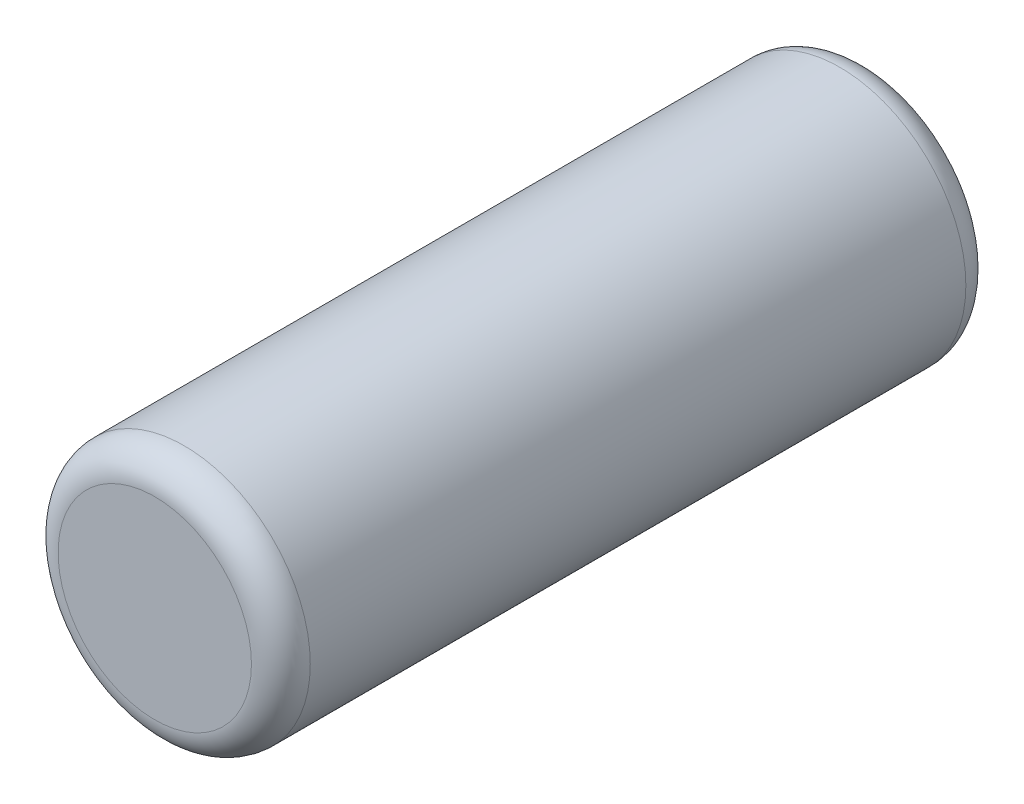
ISO-10303-21;
HEADER;
FILE_DESCRIPTION(('STEP AP214'),'2;1');
FILE_NAME('part.step','',(''),(''),'','','');
FILE_SCHEMA(('AUTOMOTIVE_DESIGN { 1 0 10303 214 1 1 1 1 }'));
ENDSEC;
DATA;
#1=APPLICATION_CONTEXT('core data for automotive mechanical design processes');
#2=APPLICATION_PROTOCOL_DEFINITION('international standard','automotive_design',2000,#1);
#3=PRODUCT_CONTEXT('',#1,'mechanical');
#4=PRODUCT('Part','Part','',(#3));
#5=PRODUCT_RELATED_PRODUCT_CATEGORY('part','',(#4));
#6=PRODUCT_DEFINITION_FORMATION('','',#4);
#7=PRODUCT_DEFINITION_CONTEXT('part definition',#1,'design');
#8=PRODUCT_DEFINITION('design','',#6,#7);
#9=PRODUCT_DEFINITION_SHAPE('','',#8);
#10=(LENGTH_UNIT() NAMED_UNIT(*) SI_UNIT(.MILLI.,.METRE.));
#11=(NAMED_UNIT(*) PLANE_ANGLE_UNIT() SI_UNIT($,.RADIAN.));
#12=(NAMED_UNIT(*) SI_UNIT($,.STERADIAN.) SOLID_ANGLE_UNIT());
#13=UNCERTAINTY_MEASURE_WITH_UNIT(LENGTH_MEASURE(1.E-05),#10,'distance_accuracy_value','');
#14=(GEOMETRIC_REPRESENTATION_CONTEXT(3) GLOBAL_UNCERTAINTY_ASSIGNED_CONTEXT((#13)) GLOBAL_UNIT_ASSIGNED_CONTEXT((#10,
#11,#12)) REPRESENTATION_CONTEXT('',''));
#15=CARTESIAN_POINT('',(0.,0.,0.));
#16=DIRECTION('',(0.,0.,1.));
#17=DIRECTION('',(1.,0.,0.));
#18=AXIS2_PLACEMENT_3D('',#15,#16,#17);
#19=CARTESIAN_POINT('',(0.,0.,4.25));
#20=DIRECTION('',(0.,0.,-1.));
#21=DIRECTION('',(-1.,0.,0.));
#22=AXIS2_PLACEMENT_3D('',#19,#20,#21);
#23=CYLINDRICAL_SURFACE('',#22,1.5);
#24=CARTESIAN_POINT('',(0.,0.,-3.9));
#25=DIRECTION('',(0.,0.,1.));
#26=DIRECTION('',(1.,0.,0.));
#27=AXIS2_PLACEMENT_3D('',#24,#25,#26);
#28=CIRCLE('',#27,1.5);
#29=CARTESIAN_POINT('',(1.5,0.,-3.9));
#30=VERTEX_POINT('',#29);
#31=EDGE_CURVE('E42',#30,#30,#28,.T.);
#32=ORIENTED_EDGE('',*,*,#31,.T.);
#33=EDGE_LOOP('',(#32));
#34=FACE_BOUND('',#33,.T.);
#35=CARTESIAN_POINT('',(0.,0.,3.9));
#36=DIRECTION('',(0.,0.,1.));
#37=DIRECTION('',(1.,0.,0.));
#38=AXIS2_PLACEMENT_3D('',#35,#36,#37);
#39=CIRCLE('',#38,1.5);
#40=CARTESIAN_POINT('',(1.5,0.,3.9));
#41=VERTEX_POINT('',#40);
#42=EDGE_CURVE('E46',#41,#41,#39,.F.);
#43=ORIENTED_EDGE('',*,*,#42,.T.);
#44=EDGE_LOOP('',(#43));
#45=FACE_BOUND('',#44,.T.);
#46=ADVANCED_FACE('F31',(#34,#45),#23,.T.);
#47=CARTESIAN_POINT('',(0.,0.,4.25));
#48=DIRECTION('',(0.,0.,1.));
#49=DIRECTION('',(1.,0.,0.));
#50=AXIS2_PLACEMENT_3D('',#47,#48,#49);
#51=PLANE('',#50);
#52=CARTESIAN_POINT('',(0.,0.,4.25));
#53=DIRECTION('',(0.,0.,1.));
#54=DIRECTION('',(1.,0.,0.));
#55=AXIS2_PLACEMENT_3D('',#52,#53,#54);
#56=CIRCLE('',#55,1.15);
#57=CARTESIAN_POINT('',(1.15,0.,4.25));
#58=VERTEX_POINT('',#57);
#59=EDGE_CURVE('E10',#58,#58,#56,.T.);
#60=ORIENTED_EDGE('',*,*,#59,.T.);
#61=EDGE_LOOP('',(#60));
#62=FACE_BOUND('',#61,.T.);
#63=ADVANCED_FACE('F62',(#62),#51,.T.);
#64=CARTESIAN_POINT('',(0.,0.,-4.25));
#65=DIRECTION('',(0.,0.,1.));
#66=DIRECTION('',(1.,0.,0.));
#67=AXIS2_PLACEMENT_3D('',#64,#65,#66);
#68=PLANE('',#67);
#69=CARTESIAN_POINT('',(0.,0.,-4.25));
#70=DIRECTION('',(0.,0.,1.));
#71=DIRECTION('',(1.,0.,0.));
#72=AXIS2_PLACEMENT_3D('',#69,#70,#71);
#73=CIRCLE('',#72,1.15);
#74=CARTESIAN_POINT('',(1.15,0.,-4.25));
#75=VERTEX_POINT('',#74);
#76=EDGE_CURVE('E38',#75,#75,#73,.F.);
#77=ORIENTED_EDGE('',*,*,#76,.T.);
#78=EDGE_LOOP('',(#77));
#79=FACE_BOUND('',#78,.T.);
#80=ADVANCED_FACE('F59',(#79),#68,.F.);
#81=CARTESIAN_POINT('',(0.,0.,-3.9));
#82=DIRECTION('',(0.,0.,1.));
#83=DIRECTION('',(1.,0.,0.));
#84=AXIS2_PLACEMENT_3D('',#81,#82,#83);
#85=TOROIDAL_SURFACE('',#84,1.15,0.35);
#86=ORIENTED_EDGE('',*,*,#76,.F.);
#87=EDGE_LOOP('',(#86));
#88=FACE_BOUND('',#87,.T.);
#89=ORIENTED_EDGE('',*,*,#31,.F.);
#90=EDGE_LOOP('',(#89));
#91=FACE_BOUND('',#90,.T.);
#92=ADVANCED_FACE('F55',(#88,#91),#85,.T.);
#93=CARTESIAN_POINT('',(0.,0.,3.9));
#94=DIRECTION('',(0.,0.,1.));
#95=DIRECTION('',(1.,0.,0.));
#96=AXIS2_PLACEMENT_3D('',#93,#94,#95);
#97=TOROIDAL_SURFACE('',#96,1.15,0.35);
#98=ORIENTED_EDGE('',*,*,#42,.F.);
#99=EDGE_LOOP('',(#98));
#100=FACE_BOUND('',#99,.T.);
#101=ORIENTED_EDGE('',*,*,#59,.F.);
#102=EDGE_LOOP('',(#101));
#103=FACE_BOUND('',#102,.T.);
#104=ADVANCED_FACE('F33',(#100,#103),#97,.T.);
#105=CLOSED_SHELL('',(#46,#63,#80,#92,#104));
#106=MANIFOLD_SOLID_BREP('B2',#105);
#107=ADVANCED_BREP_SHAPE_REPRESENTATION('',(#18,#106),#14);
#108=SHAPE_DEFINITION_REPRESENTATION(#9,#107);
ENDSEC;
END-ISO-10303-21;
